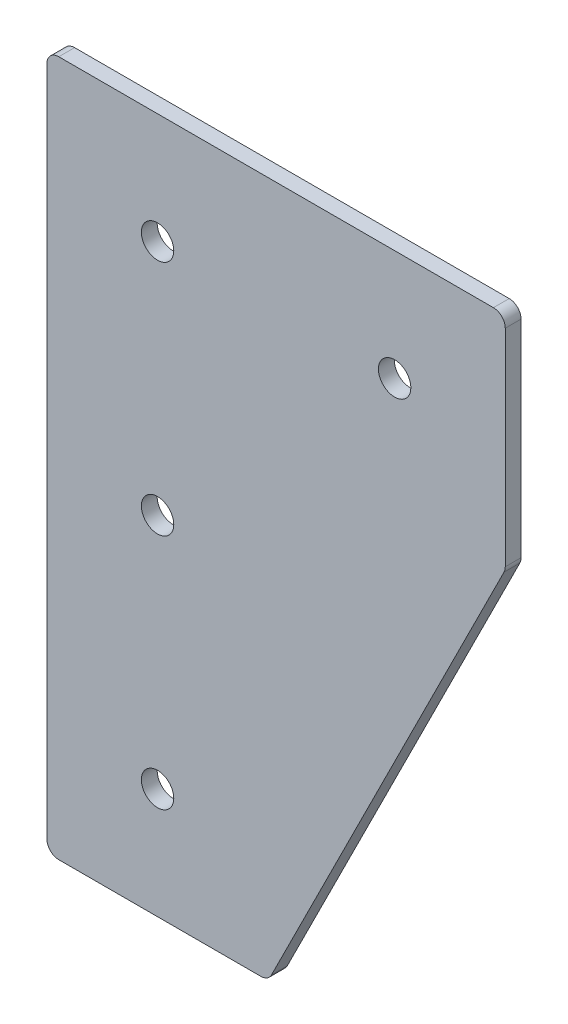
ISO-10303-21;
HEADER;
FILE_DESCRIPTION(('STEP AP214'),'2;1');
FILE_NAME('part.step','',(''),(''),'','','');
FILE_SCHEMA(('AUTOMOTIVE_DESIGN { 1 0 10303 214 1 1 1 1 }'));
ENDSEC;
DATA;
#1=APPLICATION_CONTEXT('core data for automotive mechanical design processes');
#2=APPLICATION_PROTOCOL_DEFINITION('international standard','automotive_design',2000,#1);
#3=PRODUCT_CONTEXT('',#1,'mechanical');
#4=PRODUCT('Part','Part','',(#3));
#5=PRODUCT_RELATED_PRODUCT_CATEGORY('part','',(#4));
#6=PRODUCT_DEFINITION_FORMATION('','',#4);
#7=PRODUCT_DEFINITION_CONTEXT('part definition',#1,'design');
#8=PRODUCT_DEFINITION('design','',#6,#7);
#9=PRODUCT_DEFINITION_SHAPE('','',#8);
#10=(LENGTH_UNIT() NAMED_UNIT(*) SI_UNIT(.MILLI.,.METRE.));
#11=(NAMED_UNIT(*) PLANE_ANGLE_UNIT() SI_UNIT($,.RADIAN.));
#12=(NAMED_UNIT(*) SI_UNIT($,.STERADIAN.) SOLID_ANGLE_UNIT());
#13=UNCERTAINTY_MEASURE_WITH_UNIT(LENGTH_MEASURE(1.E-05),#10,'distance_accuracy_value','');
#14=(GEOMETRIC_REPRESENTATION_CONTEXT(3) GLOBAL_UNCERTAINTY_ASSIGNED_CONTEXT((#13)) GLOBAL_UNIT_ASSIGNED_CONTEXT((#10,
#11,#12)) REPRESENTATION_CONTEXT('',''));
#15=CARTESIAN_POINT('',(0.,0.,0.));
#16=DIRECTION('',(0.,0.,1.));
#17=DIRECTION('',(1.,0.,0.));
#18=AXIS2_PLACEMENT_3D('',#15,#16,#17);
#19=CARTESIAN_POINT('',(0.,0.,4.));
#20=DIRECTION('',(0.,0.,1.));
#21=DIRECTION('',(1.,0.,0.));
#22=AXIS2_PLACEMENT_3D('',#19,#20,#21);
#23=PLANE('',#22);
#24=CARTESIAN_POINT('',(6.24792700594322E-13,-60.,4.));
#25=DIRECTION('',(0.,0.,1.));
#26=DIRECTION('',(1.,0.,0.));
#27=AXIS2_PLACEMENT_3D('',#24,#25,#26);
#28=CIRCLE('',#27,4.1);
#29=CARTESIAN_POINT('',(4.10000000000062,-60.,4.));
#30=VERTEX_POINT('',#29);
#31=EDGE_CURVE('E189',#30,#30,#28,.T.);
#32=ORIENTED_EDGE('',*,*,#31,.F.);
#33=EDGE_LOOP('',(#32));
#34=FACE_BOUND('',#33,.T.);
#35=CARTESIAN_POINT('',(0.,0.,4.));
#36=DIRECTION('',(0.,0.,1.));
#37=DIRECTION('',(1.,0.,0.));
#38=AXIS2_PLACEMENT_3D('',#35,#36,#37);
#39=CIRCLE('',#38,4.1);
#40=CARTESIAN_POINT('',(4.1,0.,4.));
#41=VERTEX_POINT('',#40);
#42=EDGE_CURVE('E175',#41,#41,#39,.T.);
#43=ORIENTED_EDGE('',*,*,#42,.F.);
#44=EDGE_LOOP('',(#43));
#45=FACE_BOUND('',#44,.T.);
#46=DIRECTION('',(1.,0.,0.));
#47=VECTOR('',#46,1.);
#48=CARTESIAN_POINT('',(-28.,-148.,4.));
#49=LINE('',#48,#47);
#50=CARTESIAN_POINT('',(-25.,-148.,4.));
#51=VERTEX_POINT('',#50);
#52=CARTESIAN_POINT('',(26.1458980337503,-148.,4.));
#53=VERTEX_POINT('',#52);
#54=EDGE_CURVE('E165',#51,#53,#49,.T.);
#55=ORIENTED_EDGE('',*,*,#54,.T.);
#56=CARTESIAN_POINT('',(26.1458980337503,-145.,4.));
#57=DIRECTION('',(0.,0.,1.));
#58=DIRECTION('',(1.,0.,0.));
#59=AXIS2_PLACEMENT_3D('',#56,#57,#58);
#60=CIRCLE('',#59,3.);
#61=CARTESIAN_POINT('',(28.8291796067501,-146.3416407865,4.));
#62=VERTEX_POINT('',#61);
#63=EDGE_CURVE('E147',#53,#62,#60,.T.);
#64=ORIENTED_EDGE('',*,*,#63,.T.);
#65=DIRECTION('',(0.447213595499958,0.894427190999916,0.));
#66=VECTOR('',#65,1.);
#67=CARTESIAN_POINT('',(28.,-148.,4.));
#68=LINE('',#67,#66);
#69=CARTESIAN_POINT('',(87.6832815729997,-28.6334368540005,4.));
#70=VERTEX_POINT('',#69);
#71=EDGE_CURVE('E116',#62,#70,#68,.T.);
#72=ORIENTED_EDGE('',*,*,#71,.T.);
#73=CARTESIAN_POINT('',(85.,-27.2917960675006,4.));
#74=DIRECTION('',(0.,0.,1.));
#75=DIRECTION('',(1.,0.,0.));
#76=AXIS2_PLACEMENT_3D('',#73,#74,#75);
#77=CIRCLE('',#76,3.);
#78=CARTESIAN_POINT('',(88.,-27.2917960675006,4.));
#79=VERTEX_POINT('',#78);
#80=EDGE_CURVE('E120',#70,#79,#77,.T.);
#81=ORIENTED_EDGE('',*,*,#80,.T.);
#82=DIRECTION('',(0.,1.,0.));
#83=VECTOR('',#82,1.);
#84=CARTESIAN_POINT('',(88.,28.,4.));
#85=LINE('',#84,#83);
#86=CARTESIAN_POINT('',(88.,25.,4.));
#87=VERTEX_POINT('',#86);
#88=EDGE_CURVE('E125',#79,#87,#85,.T.);
#89=ORIENTED_EDGE('',*,*,#88,.T.);
#90=CARTESIAN_POINT('',(85.,25.,4.));
#91=DIRECTION('',(0.,0.,1.));
#92=DIRECTION('',(1.,0.,0.));
#93=AXIS2_PLACEMENT_3D('',#90,#91,#92);
#94=CIRCLE('',#93,3.);
#95=CARTESIAN_POINT('',(85.,28.,4.));
#96=VERTEX_POINT('',#95);
#97=EDGE_CURVE('E36',#87,#96,#94,.T.);
#98=ORIENTED_EDGE('',*,*,#97,.T.);
#99=DIRECTION('',(-1.,0.,0.));
#100=VECTOR('',#99,1.);
#101=CARTESIAN_POINT('',(-28.,28.,4.));
#102=LINE('',#101,#100);
#103=CARTESIAN_POINT('',(-25.,28.,4.));
#104=VERTEX_POINT('',#103);
#105=EDGE_CURVE('E121',#96,#104,#102,.T.);
#106=ORIENTED_EDGE('',*,*,#105,.T.);
#107=CARTESIAN_POINT('',(-25.,25.,4.));
#108=DIRECTION('',(0.,0.,1.));
#109=DIRECTION('',(1.,0.,0.));
#110=AXIS2_PLACEMENT_3D('',#107,#108,#109);
#111=CIRCLE('',#110,3.);
#112=CARTESIAN_POINT('',(-28.,25.,4.));
#113=VERTEX_POINT('',#112);
#114=EDGE_CURVE('E144',#104,#113,#111,.T.);
#115=ORIENTED_EDGE('',*,*,#114,.T.);
#116=DIRECTION('',(0.,-1.,0.));
#117=VECTOR('',#116,1.);
#118=CARTESIAN_POINT('',(-28.,28.,4.));
#119=LINE('',#118,#117);
#120=CARTESIAN_POINT('',(-28.,-145.,4.));
#121=VERTEX_POINT('',#120);
#122=EDGE_CURVE('E163',#113,#121,#119,.T.);
#123=ORIENTED_EDGE('',*,*,#122,.T.);
#124=CARTESIAN_POINT('',(-25.,-145.,4.));
#125=DIRECTION('',(0.,0.,1.));
#126=DIRECTION('',(1.,0.,0.));
#127=AXIS2_PLACEMENT_3D('',#124,#125,#126);
#128=CIRCLE('',#127,3.);
#129=EDGE_CURVE('E142',#121,#51,#128,.T.);
#130=ORIENTED_EDGE('',*,*,#129,.T.);
#131=EDGE_LOOP('',(#55,#64,#72,#81,#89,#98,#106,#115,#123,#130));
#132=FACE_BOUND('',#131,.T.);
#133=CARTESIAN_POINT('',(60.,0.,4.));
#134=DIRECTION('',(0.,0.,1.));
#135=DIRECTION('',(1.,0.,0.));
#136=AXIS2_PLACEMENT_3D('',#133,#134,#135);
#137=CIRCLE('',#136,4.09999999999999);
#138=CARTESIAN_POINT('',(64.1,0.,4.));
#139=VERTEX_POINT('',#138);
#140=EDGE_CURVE('E183',#139,#139,#137,.T.);
#141=ORIENTED_EDGE('',*,*,#140,.F.);
#142=EDGE_LOOP('',(#141));
#143=FACE_BOUND('',#142,.T.);
#144=CARTESIAN_POINT('',(1.24958540118864E-12,-120.,4.));
#145=DIRECTION('',(0.,0.,1.));
#146=DIRECTION('',(1.,0.,0.));
#147=AXIS2_PLACEMENT_3D('',#144,#145,#146);
#148=CIRCLE('',#147,4.1);
#149=CARTESIAN_POINT('',(4.10000000000125,-120.,4.));
#150=VERTEX_POINT('',#149);
#151=EDGE_CURVE('E195',#150,#150,#148,.T.);
#152=ORIENTED_EDGE('',*,*,#151,.F.);
#153=EDGE_LOOP('',(#152));
#154=FACE_BOUND('',#153,.T.);
#155=ADVANCED_FACE('F16',(#34,#45,#132,#143,#154),#23,.T.);
#156=CARTESIAN_POINT('',(0.,0.,0.));
#157=DIRECTION('',(0.,0.,1.));
#158=DIRECTION('',(1.,0.,0.));
#159=AXIS2_PLACEMENT_3D('',#156,#157,#158);
#160=PLANE('',#159);
#161=DIRECTION('',(-0.447213595499958,-0.894427190999916,0.));
#162=VECTOR('',#161,1.);
#163=CARTESIAN_POINT('',(28.,-148.,0.));
#164=LINE('',#163,#162);
#165=CARTESIAN_POINT('',(87.6832815729998,-28.6334368540005,0.));
#166=VERTEX_POINT('',#165);
#167=CARTESIAN_POINT('',(28.8291796067501,-146.3416407865,0.));
#168=VERTEX_POINT('',#167);
#169=EDGE_CURVE('E97',#166,#168,#164,.T.);
#170=ORIENTED_EDGE('',*,*,#169,.T.);
#171=CARTESIAN_POINT('',(26.1458980337503,-145.,0.));
#172=DIRECTION('',(0.,0.,1.));
#173=DIRECTION('',(1.,0.,0.));
#174=AXIS2_PLACEMENT_3D('',#171,#172,#173);
#175=CIRCLE('',#174,3.);
#176=CARTESIAN_POINT('',(26.1458980337503,-148.,0.));
#177=VERTEX_POINT('',#176);
#178=EDGE_CURVE('E104',#168,#177,#175,.F.);
#179=ORIENTED_EDGE('',*,*,#178,.T.);
#180=DIRECTION('',(1.,0.,0.));
#181=VECTOR('',#180,1.);
#182=CARTESIAN_POINT('',(-28.,-148.,0.));
#183=LINE('',#182,#181);
#184=CARTESIAN_POINT('',(-25.,-148.,0.));
#185=VERTEX_POINT('',#184);
#186=EDGE_CURVE('E167',#185,#177,#183,.T.);
#187=ORIENTED_EDGE('',*,*,#186,.F.);
#188=CARTESIAN_POINT('',(-25.,-145.,0.));
#189=DIRECTION('',(0.,0.,1.));
#190=DIRECTION('',(1.,0.,0.));
#191=AXIS2_PLACEMENT_3D('',#188,#189,#190);
#192=CIRCLE('',#191,3.);
#193=CARTESIAN_POINT('',(-28.,-145.,0.));
#194=VERTEX_POINT('',#193);
#195=EDGE_CURVE('E132',#185,#194,#192,.F.);
#196=ORIENTED_EDGE('',*,*,#195,.T.);
#197=DIRECTION('',(0.,-1.,0.));
#198=VECTOR('',#197,1.);
#199=CARTESIAN_POINT('',(-28.,-28.,0.));
#200=LINE('',#199,#198);
#201=CARTESIAN_POINT('',(-28.,25.,0.));
#202=VERTEX_POINT('',#201);
#203=EDGE_CURVE('E171',#202,#194,#200,.T.);
#204=ORIENTED_EDGE('',*,*,#203,.F.);
#205=CARTESIAN_POINT('',(-25.,25.,0.));
#206=DIRECTION('',(0.,0.,1.));
#207=DIRECTION('',(1.,0.,0.));
#208=AXIS2_PLACEMENT_3D('',#205,#206,#207);
#209=CIRCLE('',#208,3.);
#210=CARTESIAN_POINT('',(-25.,28.,0.));
#211=VERTEX_POINT('',#210);
#212=EDGE_CURVE('E105',#202,#211,#209,.F.);
#213=ORIENTED_EDGE('',*,*,#212,.T.);
#214=DIRECTION('',(-1.,0.,0.));
#215=VECTOR('',#214,1.);
#216=CARTESIAN_POINT('',(-28.,28.,0.));
#217=LINE('',#216,#215);
#218=CARTESIAN_POINT('',(85.,28.,0.));
#219=VERTEX_POINT('',#218);
#220=EDGE_CURVE('E128',#219,#211,#217,.T.);
#221=ORIENTED_EDGE('',*,*,#220,.F.);
#222=CARTESIAN_POINT('',(85.,25.,0.));
#223=DIRECTION('',(0.,0.,1.));
#224=DIRECTION('',(1.,0.,0.));
#225=AXIS2_PLACEMENT_3D('',#222,#223,#224);
#226=CIRCLE('',#225,3.);
#227=CARTESIAN_POINT('',(88.,25.,0.));
#228=VERTEX_POINT('',#227);
#229=EDGE_CURVE('E123',#219,#228,#226,.F.);
#230=ORIENTED_EDGE('',*,*,#229,.T.);
#231=DIRECTION('',(0.,1.,0.));
#232=VECTOR('',#231,1.);
#233=CARTESIAN_POINT('',(88.,28.,0.));
#234=LINE('',#233,#232);
#235=CARTESIAN_POINT('',(88.,-27.2917960675006,0.));
#236=VERTEX_POINT('',#235);
#237=EDGE_CURVE('E99',#236,#228,#234,.T.);
#238=ORIENTED_EDGE('',*,*,#237,.F.);
#239=CARTESIAN_POINT('',(85.,-27.2917960675006,0.));
#240=DIRECTION('',(0.,0.,1.));
#241=DIRECTION('',(1.,0.,0.));
#242=AXIS2_PLACEMENT_3D('',#239,#240,#241);
#243=CIRCLE('',#242,3.);
#244=EDGE_CURVE('E93',#236,#166,#243,.F.);
#245=ORIENTED_EDGE('',*,*,#244,.T.);
#246=EDGE_LOOP('',(#170,#179,#187,#196,#204,#213,#221,#230,#238,#245));
#247=FACE_BOUND('',#246,.T.);
#248=CARTESIAN_POINT('',(0.,0.,0.));
#249=DIRECTION('',(0.,0.,1.));
#250=DIRECTION('',(1.,0.,0.));
#251=AXIS2_PLACEMENT_3D('',#248,#249,#250);
#252=CIRCLE('',#251,4.1);
#253=CARTESIAN_POINT('',(4.1,0.,0.));
#254=VERTEX_POINT('',#253);
#255=EDGE_CURVE('E180',#254,#254,#252,.T.);
#256=ORIENTED_EDGE('',*,*,#255,.T.);
#257=EDGE_LOOP('',(#256));
#258=FACE_BOUND('',#257,.T.);
#259=CARTESIAN_POINT('',(60.,0.,0.));
#260=DIRECTION('',(0.,0.,1.));
#261=DIRECTION('',(1.,0.,0.));
#262=AXIS2_PLACEMENT_3D('',#259,#260,#261);
#263=CIRCLE('',#262,4.09999999999999);
#264=CARTESIAN_POINT('',(64.1,0.,0.));
#265=VERTEX_POINT('',#264);
#266=EDGE_CURVE('E186',#265,#265,#263,.T.);
#267=ORIENTED_EDGE('',*,*,#266,.T.);
#268=EDGE_LOOP('',(#267));
#269=FACE_BOUND('',#268,.T.);
#270=CARTESIAN_POINT('',(6.24792700594322E-13,-60.,0.));
#271=DIRECTION('',(0.,0.,1.));
#272=DIRECTION('',(1.,0.,0.));
#273=AXIS2_PLACEMENT_3D('',#270,#271,#272);
#274=CIRCLE('',#273,4.1);
#275=CARTESIAN_POINT('',(4.10000000000062,-60.,0.));
#276=VERTEX_POINT('',#275);
#277=EDGE_CURVE('E192',#276,#276,#274,.T.);
#278=ORIENTED_EDGE('',*,*,#277,.T.);
#279=EDGE_LOOP('',(#278));
#280=FACE_BOUND('',#279,.T.);
#281=CARTESIAN_POINT('',(1.24958540118864E-12,-120.,0.));
#282=DIRECTION('',(0.,0.,1.));
#283=DIRECTION('',(1.,0.,0.));
#284=AXIS2_PLACEMENT_3D('',#281,#282,#283);
#285=CIRCLE('',#284,4.1);
#286=CARTESIAN_POINT('',(4.10000000000125,-120.,0.));
#287=VERTEX_POINT('',#286);
#288=EDGE_CURVE('E115',#287,#287,#285,.T.);
#289=ORIENTED_EDGE('',*,*,#288,.T.);
#290=EDGE_LOOP('',(#289));
#291=FACE_BOUND('',#290,.T.);
#292=ADVANCED_FACE('F95',(#247,#258,#269,#280,#291),#160,.F.);
#293=CARTESIAN_POINT('',(-28.,-28.,4.));
#294=DIRECTION('',(1.,0.,0.));
#295=DIRECTION('',(0.,1.,0.));
#296=AXIS2_PLACEMENT_3D('',#293,#294,#295);
#297=PLANE('',#296);
#298=ORIENTED_EDGE('',*,*,#122,.F.);
#299=DIRECTION('',(0.,0.,-1.));
#300=VECTOR('',#299,1.);
#301=CARTESIAN_POINT('',(-28.,25.,4.));
#302=LINE('',#301,#300);
#303=EDGE_CURVE('E155',#113,#202,#302,.T.);
#304=ORIENTED_EDGE('',*,*,#303,.T.);
#305=ORIENTED_EDGE('',*,*,#203,.T.);
#306=DIRECTION('',(0.,0.,-1.));
#307=VECTOR('',#306,1.);
#308=CARTESIAN_POINT('',(-28.,-145.,4.));
#309=LINE('',#308,#307);
#310=EDGE_CURVE('E153',#194,#121,#309,.F.);
#311=ORIENTED_EDGE('',*,*,#310,.T.);
#312=EDGE_LOOP('',(#298,#304,#305,#311));
#313=FACE_BOUND('',#312,.T.);
#314=ADVANCED_FACE('F219',(#313),#297,.F.);
#315=CARTESIAN_POINT('',(-28.,-148.,4.));
#316=DIRECTION('',(0.,1.,0.));
#317=DIRECTION('',(0.,0.,1.));
#318=AXIS2_PLACEMENT_3D('',#315,#316,#317);
#319=PLANE('',#318);
#320=ORIENTED_EDGE('',*,*,#186,.T.);
#321=DIRECTION('',(0.,0.,-1.));
#322=VECTOR('',#321,1.);
#323=CARTESIAN_POINT('',(26.1458980337503,-148.,4.));
#324=LINE('',#323,#322);
#325=EDGE_CURVE('E139',#177,#53,#324,.F.);
#326=ORIENTED_EDGE('',*,*,#325,.T.);
#327=ORIENTED_EDGE('',*,*,#54,.F.);
#328=DIRECTION('',(0.,0.,-1.));
#329=VECTOR('',#328,1.);
#330=CARTESIAN_POINT('',(-25.,-148.,4.));
#331=LINE('',#330,#329);
#332=EDGE_CURVE('E136',#51,#185,#331,.T.);
#333=ORIENTED_EDGE('',*,*,#332,.T.);
#334=EDGE_LOOP('',(#320,#326,#327,#333));
#335=FACE_BOUND('',#334,.T.);
#336=ADVANCED_FACE('F210',(#335),#319,.F.);
#337=CARTESIAN_POINT('',(88.,28.,4.));
#338=DIRECTION('',(-1.,0.,0.));
#339=DIRECTION('',(0.,0.,1.));
#340=AXIS2_PLACEMENT_3D('',#337,#338,#339);
#341=PLANE('',#340);
#342=ORIENTED_EDGE('',*,*,#88,.F.);
#343=DIRECTION('',(0.,0.,-1.));
#344=VECTOR('',#343,1.);
#345=CARTESIAN_POINT('',(88.,-27.2917960675006,0.));
#346=LINE('',#345,#344);
#347=EDGE_CURVE('E151',#79,#236,#346,.T.);
#348=ORIENTED_EDGE('',*,*,#347,.T.);
#349=ORIENTED_EDGE('',*,*,#237,.T.);
#350=DIRECTION('',(0.,0.,-1.));
#351=VECTOR('',#350,1.);
#352=CARTESIAN_POINT('',(88.,25.,4.));
#353=LINE('',#352,#351);
#354=EDGE_CURVE('E149',#228,#87,#353,.F.);
#355=ORIENTED_EDGE('',*,*,#354,.T.);
#356=EDGE_LOOP('',(#342,#348,#349,#355));
#357=FACE_BOUND('',#356,.T.);
#358=ADVANCED_FACE('F247',(#357),#341,.F.);
#359=CARTESIAN_POINT('',(-28.,28.,4.));
#360=DIRECTION('',(0.,-1.,0.));
#361=DIRECTION('',(1.,0.,0.));
#362=AXIS2_PLACEMENT_3D('',#359,#360,#361);
#363=PLANE('',#362);
#364=ORIENTED_EDGE('',*,*,#220,.T.);
#365=DIRECTION('',(0.,0.,-1.));
#366=VECTOR('',#365,1.);
#367=CARTESIAN_POINT('',(-25.,28.,4.));
#368=LINE('',#367,#366);
#369=EDGE_CURVE('E10',#211,#104,#368,.F.);
#370=ORIENTED_EDGE('',*,*,#369,.T.);
#371=ORIENTED_EDGE('',*,*,#105,.F.);
#372=DIRECTION('',(0.,0.,-1.));
#373=VECTOR('',#372,1.);
#374=CARTESIAN_POINT('',(85.,28.,4.));
#375=LINE('',#374,#373);
#376=EDGE_CURVE('E24',#96,#219,#375,.T.);
#377=ORIENTED_EDGE('',*,*,#376,.T.);
#378=EDGE_LOOP('',(#364,#370,#371,#377));
#379=FACE_BOUND('',#378,.T.);
#380=ADVANCED_FACE('F160',(#379),#363,.F.);
#381=CARTESIAN_POINT('',(0.,0.,4.));
#382=DIRECTION('',(0.,0.,-1.));
#383=DIRECTION('',(-1.,0.,0.));
#384=AXIS2_PLACEMENT_3D('',#381,#382,#383);
#385=CYLINDRICAL_SURFACE('',#384,4.1);
#386=ORIENTED_EDGE('',*,*,#42,.T.);
#387=EDGE_LOOP('',(#386));
#388=FACE_BOUND('',#387,.T.);
#389=ORIENTED_EDGE('',*,*,#255,.F.);
#390=EDGE_LOOP('',(#389));
#391=FACE_BOUND('',#390,.T.);
#392=ADVANCED_FACE('F242',(#388,#391),#385,.F.);
#393=CARTESIAN_POINT('',(60.,0.,4.));
#394=DIRECTION('',(0.,0.,-1.));
#395=DIRECTION('',(-1.,0.,0.));
#396=AXIS2_PLACEMENT_3D('',#393,#394,#395);
#397=CYLINDRICAL_SURFACE('',#396,4.09999999999999);
#398=ORIENTED_EDGE('',*,*,#140,.T.);
#399=EDGE_LOOP('',(#398));
#400=FACE_BOUND('',#399,.T.);
#401=ORIENTED_EDGE('',*,*,#266,.F.);
#402=EDGE_LOOP('',(#401));
#403=FACE_BOUND('',#402,.T.);
#404=ADVANCED_FACE('F268',(#400,#403),#397,.F.);
#405=CARTESIAN_POINT('',(6.24792700594322E-13,-60.,4.));
#406=DIRECTION('',(0.,0.,-1.));
#407=DIRECTION('',(-1.,0.,0.));
#408=AXIS2_PLACEMENT_3D('',#405,#406,#407);
#409=CYLINDRICAL_SURFACE('',#408,4.1);
#410=ORIENTED_EDGE('',*,*,#31,.T.);
#411=EDGE_LOOP('',(#410));
#412=FACE_BOUND('',#411,.T.);
#413=ORIENTED_EDGE('',*,*,#277,.F.);
#414=EDGE_LOOP('',(#413));
#415=FACE_BOUND('',#414,.T.);
#416=ADVANCED_FACE('F263',(#412,#415),#409,.F.);
#417=CARTESIAN_POINT('',(1.24958540118864E-12,-120.,4.));
#418=DIRECTION('',(0.,0.,-1.));
#419=DIRECTION('',(-1.,0.,0.));
#420=AXIS2_PLACEMENT_3D('',#417,#418,#419);
#421=CYLINDRICAL_SURFACE('',#420,4.1);
#422=ORIENTED_EDGE('',*,*,#151,.T.);
#423=EDGE_LOOP('',(#422));
#424=FACE_BOUND('',#423,.T.);
#425=ORIENTED_EDGE('',*,*,#288,.F.);
#426=EDGE_LOOP('',(#425));
#427=FACE_BOUND('',#426,.T.);
#428=ADVANCED_FACE('F258',(#424,#427),#421,.F.);
#429=CARTESIAN_POINT('',(28.,-148.,-134.164078649987));
#430=DIRECTION('',(0.894427190999916,-0.447213595499958,0.));
#431=DIRECTION('',(0.447213595499958,0.894427190999916,0.));
#432=AXIS2_PLACEMENT_3D('',#429,#430,#431);
#433=PLANE('',#432);
#434=ORIENTED_EDGE('',*,*,#71,.F.);
#435=DIRECTION('',(0.,0.,-1.));
#436=VECTOR('',#435,1.);
#437=CARTESIAN_POINT('',(28.8291796067501,-146.3416407865,0.));
#438=LINE('',#437,#436);
#439=EDGE_CURVE('E114',#62,#168,#438,.T.);
#440=ORIENTED_EDGE('',*,*,#439,.T.);
#441=ORIENTED_EDGE('',*,*,#169,.F.);
#442=DIRECTION('',(0.,0.,-1.));
#443=VECTOR('',#442,1.);
#444=CARTESIAN_POINT('',(87.6832815729997,-28.6334368540005,4.));
#445=LINE('',#444,#443);
#446=EDGE_CURVE('E111',#166,#70,#445,.F.);
#447=ORIENTED_EDGE('',*,*,#446,.T.);
#448=EDGE_LOOP('',(#434,#440,#441,#447));
#449=FACE_BOUND('',#448,.T.);
#450=ADVANCED_FACE('F110',(#449),#433,.T.);
#451=CARTESIAN_POINT('',(26.1458980337503,-145.,-134.164078649987));
#452=DIRECTION('',(0.,0.,1.));
#453=DIRECTION('',(1.,0.,0.));
#454=AXIS2_PLACEMENT_3D('',#451,#452,#453);
#455=CYLINDRICAL_SURFACE('',#454,3.);
#456=ORIENTED_EDGE('',*,*,#63,.F.);
#457=ORIENTED_EDGE('',*,*,#325,.F.);
#458=ORIENTED_EDGE('',*,*,#178,.F.);
#459=ORIENTED_EDGE('',*,*,#439,.F.);
#460=EDGE_LOOP('',(#456,#457,#458,#459));
#461=FACE_BOUND('',#460,.T.);
#462=ADVANCED_FACE('F206',(#461),#455,.T.);
#463=CARTESIAN_POINT('',(85.,-27.2917960675006,4.));
#464=DIRECTION('',(0.,0.,1.));
#465=DIRECTION('',(1.,0.,0.));
#466=AXIS2_PLACEMENT_3D('',#463,#464,#465);
#467=CYLINDRICAL_SURFACE('',#466,3.);
#468=ORIENTED_EDGE('',*,*,#80,.F.);
#469=ORIENTED_EDGE('',*,*,#446,.F.);
#470=ORIENTED_EDGE('',*,*,#244,.F.);
#471=ORIENTED_EDGE('',*,*,#347,.F.);
#472=EDGE_LOOP('',(#468,#469,#470,#471));
#473=FACE_BOUND('',#472,.T.);
#474=ADVANCED_FACE('F119',(#473),#467,.T.);
#475=CARTESIAN_POINT('',(-25.,25.,4.));
#476=DIRECTION('',(0.,0.,-1.));
#477=DIRECTION('',(-1.,0.,0.));
#478=AXIS2_PLACEMENT_3D('',#475,#476,#477);
#479=CYLINDRICAL_SURFACE('',#478,3.);
#480=ORIENTED_EDGE('',*,*,#114,.F.);
#481=ORIENTED_EDGE('',*,*,#369,.F.);
#482=ORIENTED_EDGE('',*,*,#212,.F.);
#483=ORIENTED_EDGE('',*,*,#303,.F.);
#484=EDGE_LOOP('',(#480,#481,#482,#483));
#485=FACE_BOUND('',#484,.T.);
#486=ADVANCED_FACE('F223',(#485),#479,.T.);
#487=CARTESIAN_POINT('',(-25.,-145.,4.));
#488=DIRECTION('',(0.,0.,-1.));
#489=DIRECTION('',(-1.,0.,0.));
#490=AXIS2_PLACEMENT_3D('',#487,#488,#489);
#491=CYLINDRICAL_SURFACE('',#490,3.);
#492=ORIENTED_EDGE('',*,*,#129,.F.);
#493=ORIENTED_EDGE('',*,*,#310,.F.);
#494=ORIENTED_EDGE('',*,*,#195,.F.);
#495=ORIENTED_EDGE('',*,*,#332,.F.);
#496=EDGE_LOOP('',(#492,#493,#494,#495));
#497=FACE_BOUND('',#496,.T.);
#498=ADVANCED_FACE('F215',(#497),#491,.T.);
#499=CARTESIAN_POINT('',(85.,25.,4.));
#500=DIRECTION('',(0.,0.,-1.));
#501=DIRECTION('',(-1.,0.,0.));
#502=AXIS2_PLACEMENT_3D('',#499,#500,#501);
#503=CYLINDRICAL_SURFACE('',#502,3.);
#504=ORIENTED_EDGE('',*,*,#97,.F.);
#505=ORIENTED_EDGE('',*,*,#354,.F.);
#506=ORIENTED_EDGE('',*,*,#229,.F.);
#507=ORIENTED_EDGE('',*,*,#376,.F.);
#508=EDGE_LOOP('',(#504,#505,#506,#507));
#509=FACE_BOUND('',#508,.T.);
#510=ADVANCED_FACE('F18',(#509),#503,.T.);
#511=CLOSED_SHELL('',(#155,#292,#314,#336,#358,#380,#392,#404,#416,#428,#450,#462,#474,#486,
#498,#510));
#512=MANIFOLD_SOLID_BREP('B1',#511);
#513=ADVANCED_BREP_SHAPE_REPRESENTATION('',(#18,#512),#14);
#514=SHAPE_DEFINITION_REPRESENTATION(#9,#513);
ENDSEC;
END-ISO-10303-21;
